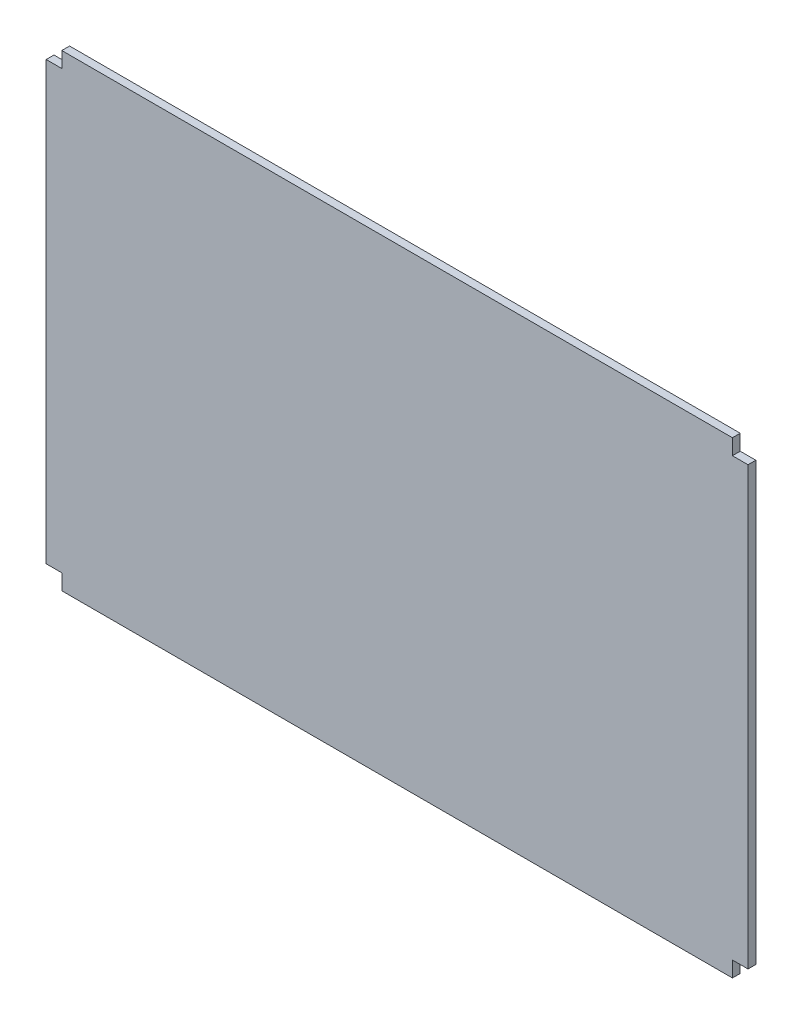
ISO-10303-21;
HEADER;
FILE_DESCRIPTION(('STEP AP214'),'2;1');
FILE_NAME('part.step','',(''),(''),'','','');
FILE_SCHEMA(('AUTOMOTIVE_DESIGN { 1 0 10303 214 1 1 1 1 }'));
ENDSEC;
DATA;
#1=APPLICATION_CONTEXT('core data for automotive mechanical design processes');
#2=APPLICATION_PROTOCOL_DEFINITION('international standard','automotive_design',2000,#1);
#3=PRODUCT_CONTEXT('',#1,'mechanical');
#4=PRODUCT('Part','Part','',(#3));
#5=PRODUCT_RELATED_PRODUCT_CATEGORY('part','',(#4));
#6=PRODUCT_DEFINITION_FORMATION('','',#4);
#7=PRODUCT_DEFINITION_CONTEXT('part definition',#1,'design');
#8=PRODUCT_DEFINITION('design','',#6,#7);
#9=PRODUCT_DEFINITION_SHAPE('','',#8);
#10=(LENGTH_UNIT() NAMED_UNIT(*) SI_UNIT(.MILLI.,.METRE.));
#11=(NAMED_UNIT(*) PLANE_ANGLE_UNIT() SI_UNIT($,.RADIAN.));
#12=(NAMED_UNIT(*) SI_UNIT($,.STERADIAN.) SOLID_ANGLE_UNIT());
#13=UNCERTAINTY_MEASURE_WITH_UNIT(LENGTH_MEASURE(1.E-05),#10,'distance_accuracy_value','');
#14=(GEOMETRIC_REPRESENTATION_CONTEXT(3) GLOBAL_UNCERTAINTY_ASSIGNED_CONTEXT((#13)) GLOBAL_UNIT_ASSIGNED_CONTEXT((#10,
#11,#12)) REPRESENTATION_CONTEXT('',''));
#15=CARTESIAN_POINT('',(0.,0.,0.));
#16=DIRECTION('',(0.,0.,1.));
#17=DIRECTION('',(1.,0.,0.));
#18=AXIS2_PLACEMENT_3D('',#15,#16,#17);
#19=CARTESIAN_POINT('',(0.,0.,10.));
#20=DIRECTION('',(1.,0.,0.));
#21=DIRECTION('',(0.,0.,-1.));
#22=AXIS2_PLACEMENT_3D('',#19,#20,#21);
#23=PLANE('',#22);
#24=DIRECTION('',(0.,-1.,0.));
#25=VECTOR('',#24,1.);
#26=CARTESIAN_POINT('',(0.,0.,0.));
#27=LINE('',#26,#25);
#28=CARTESIAN_POINT('',(0.,580.,0.));
#29=VERTEX_POINT('',#28);
#30=CARTESIAN_POINT('',(0.,19.9999999999999,0.));
#31=VERTEX_POINT('',#30);
#32=EDGE_CURVE('E158',#29,#31,#27,.T.);
#33=ORIENTED_EDGE('',*,*,#32,.T.);
#34=DIRECTION('',(0.,0.,1.));
#35=VECTOR('',#34,1.);
#36=CARTESIAN_POINT('',(0.,19.9999999999999,0.));
#37=LINE('',#36,#35);
#38=CARTESIAN_POINT('',(0.,19.9999999999999,10.));
#39=VERTEX_POINT('',#38);
#40=EDGE_CURVE('E186',#31,#39,#37,.T.);
#41=ORIENTED_EDGE('',*,*,#40,.T.);
#42=DIRECTION('',(0.,-1.,0.));
#43=VECTOR('',#42,1.);
#44=CARTESIAN_POINT('',(0.,0.,10.));
#45=LINE('',#44,#43);
#46=CARTESIAN_POINT('',(0.,580.,10.));
#47=VERTEX_POINT('',#46);
#48=EDGE_CURVE('E146',#47,#39,#45,.T.);
#49=ORIENTED_EDGE('',*,*,#48,.F.);
#50=DIRECTION('',(0.,0.,1.));
#51=VECTOR('',#50,1.);
#52=CARTESIAN_POINT('',(0.,580.,0.));
#53=LINE('',#52,#51);
#54=EDGE_CURVE('E168',#29,#47,#53,.T.);
#55=ORIENTED_EDGE('',*,*,#54,.F.);
#56=EDGE_LOOP('',(#33,#41,#49,#55));
#57=FACE_BOUND('',#56,.T.);
#58=ADVANCED_FACE('F33',(#57),#23,.F.);
#59=CARTESIAN_POINT('',(0.,0.,10.));
#60=DIRECTION('',(0.,1.,0.));
#61=DIRECTION('',(0.,0.,1.));
#62=AXIS2_PLACEMENT_3D('',#59,#60,#61);
#63=PLANE('',#62);
#64=DIRECTION('',(1.,0.,0.));
#65=VECTOR('',#64,1.);
#66=CARTESIAN_POINT('',(0.,0.,10.));
#67=LINE('',#66,#65);
#68=CARTESIAN_POINT('',(20.0000000000001,0.,10.));
#69=VERTEX_POINT('',#68);
#70=CARTESIAN_POINT('',(880.,0.,10.));
#71=VERTEX_POINT('',#70);
#72=EDGE_CURVE('E149',#69,#71,#67,.T.);
#73=ORIENTED_EDGE('',*,*,#72,.F.);
#74=DIRECTION('',(0.,0.,1.));
#75=VECTOR('',#74,1.);
#76=CARTESIAN_POINT('',(20.0000000000001,0.,0.));
#77=LINE('',#76,#75);
#78=CARTESIAN_POINT('',(20.0000000000001,0.,0.));
#79=VERTEX_POINT('',#78);
#80=EDGE_CURVE('E182',#79,#69,#77,.T.);
#81=ORIENTED_EDGE('',*,*,#80,.F.);
#82=DIRECTION('',(1.,0.,0.));
#83=VECTOR('',#82,1.);
#84=CARTESIAN_POINT('',(0.,0.,0.));
#85=LINE('',#84,#83);
#86=CARTESIAN_POINT('',(880.,0.,0.));
#87=VERTEX_POINT('',#86);
#88=EDGE_CURVE('E152',#79,#87,#85,.T.);
#89=ORIENTED_EDGE('',*,*,#88,.T.);
#90=DIRECTION('',(0.,0.,1.));
#91=VECTOR('',#90,1.);
#92=CARTESIAN_POINT('',(880.,0.,0.));
#93=LINE('',#92,#91);
#94=EDGE_CURVE('E203',#87,#71,#93,.T.);
#95=ORIENTED_EDGE('',*,*,#94,.T.);
#96=EDGE_LOOP('',(#73,#81,#89,#95));
#97=FACE_BOUND('',#96,.T.);
#98=ADVANCED_FACE('F234',(#97),#63,.F.);
#99=CARTESIAN_POINT('',(900.,0.,10.));
#100=DIRECTION('',(-1.,0.,0.));
#101=DIRECTION('',(0.,0.,1.));
#102=AXIS2_PLACEMENT_3D('',#99,#100,#101);
#103=PLANE('',#102);
#104=DIRECTION('',(0.,1.,0.));
#105=VECTOR('',#104,1.);
#106=CARTESIAN_POINT('',(900.,0.,10.));
#107=LINE('',#106,#105);
#108=CARTESIAN_POINT('',(900.,20.,10.));
#109=VERTEX_POINT('',#108);
#110=CARTESIAN_POINT('',(900.,580.,10.));
#111=VERTEX_POINT('',#110);
#112=EDGE_CURVE('E41',#109,#111,#107,.T.);
#113=ORIENTED_EDGE('',*,*,#112,.F.);
#114=DIRECTION('',(0.,0.,1.));
#115=VECTOR('',#114,1.);
#116=CARTESIAN_POINT('',(900.,20.,0.));
#117=LINE('',#116,#115);
#118=CARTESIAN_POINT('',(900.,20.,0.));
#119=VERTEX_POINT('',#118);
#120=EDGE_CURVE('E199',#119,#109,#117,.T.);
#121=ORIENTED_EDGE('',*,*,#120,.F.);
#122=DIRECTION('',(0.,1.,0.));
#123=VECTOR('',#122,1.);
#124=CARTESIAN_POINT('',(900.,0.,0.));
#125=LINE('',#124,#123);
#126=CARTESIAN_POINT('',(900.,580.,0.));
#127=VERTEX_POINT('',#126);
#128=EDGE_CURVE('E147',#119,#127,#125,.T.);
#129=ORIENTED_EDGE('',*,*,#128,.T.);
#130=DIRECTION('',(0.,0.,1.));
#131=VECTOR('',#130,1.);
#132=CARTESIAN_POINT('',(900.,580.,0.));
#133=LINE('',#132,#131);
#134=EDGE_CURVE('E179',#127,#111,#133,.T.);
#135=ORIENTED_EDGE('',*,*,#134,.T.);
#136=EDGE_LOOP('',(#113,#121,#129,#135));
#137=FACE_BOUND('',#136,.T.);
#138=ADVANCED_FACE('F223',(#137),#103,.F.);
#139=CARTESIAN_POINT('',(0.,600.,10.));
#140=DIRECTION('',(0.,-1.,0.));
#141=DIRECTION('',(0.,0.,-1.));
#142=AXIS2_PLACEMENT_3D('',#139,#140,#141);
#143=PLANE('',#142);
#144=DIRECTION('',(-1.,0.,0.));
#145=VECTOR('',#144,1.);
#146=CARTESIAN_POINT('',(0.,600.,10.));
#147=LINE('',#146,#145);
#148=CARTESIAN_POINT('',(880.,600.,10.));
#149=VERTEX_POINT('',#148);
#150=CARTESIAN_POINT('',(20.,600.,10.));
#151=VERTEX_POINT('',#150);
#152=EDGE_CURVE('E11',#149,#151,#147,.T.);
#153=ORIENTED_EDGE('',*,*,#152,.F.);
#154=DIRECTION('',(0.,0.,1.));
#155=VECTOR('',#154,1.);
#156=CARTESIAN_POINT('',(880.,600.,0.));
#157=LINE('',#156,#155);
#158=CARTESIAN_POINT('',(880.,600.,0.));
#159=VERTEX_POINT('',#158);
#160=EDGE_CURVE('E127',#159,#149,#157,.T.);
#161=ORIENTED_EDGE('',*,*,#160,.F.);
#162=DIRECTION('',(-1.,0.,0.));
#163=VECTOR('',#162,1.);
#164=CARTESIAN_POINT('',(0.,600.,0.));
#165=LINE('',#164,#163);
#166=CARTESIAN_POINT('',(20.,600.,0.));
#167=VERTEX_POINT('',#166);
#168=EDGE_CURVE('E36',#159,#167,#165,.T.);
#169=ORIENTED_EDGE('',*,*,#168,.T.);
#170=DIRECTION('',(0.,0.,1.));
#171=VECTOR('',#170,1.);
#172=CARTESIAN_POINT('',(20.,600.,0.));
#173=LINE('',#172,#171);
#174=EDGE_CURVE('E162',#167,#151,#173,.T.);
#175=ORIENTED_EDGE('',*,*,#174,.T.);
#176=EDGE_LOOP('',(#153,#161,#169,#175));
#177=FACE_BOUND('',#176,.T.);
#178=ADVANCED_FACE('F139',(#177),#143,.F.);
#179=CARTESIAN_POINT('',(0.,0.,10.));
#180=DIRECTION('',(0.,0.,-1.));
#181=DIRECTION('',(-1.,0.,0.));
#182=AXIS2_PLACEMENT_3D('',#179,#180,#181);
#183=PLANE('',#182);
#184=ORIENTED_EDGE('',*,*,#48,.T.);
#185=DIRECTION('',(-1.,0.,0.));
#186=VECTOR('',#185,1.);
#187=CARTESIAN_POINT('',(0.,19.9999999999999,10.));
#188=LINE('',#187,#186);
#189=CARTESIAN_POINT('',(20.0000000000001,19.9999999999999,10.));
#190=VERTEX_POINT('',#189);
#191=EDGE_CURVE('E190',#190,#39,#188,.T.);
#192=ORIENTED_EDGE('',*,*,#191,.F.);
#193=DIRECTION('',(0.,1.,0.));
#194=VECTOR('',#193,1.);
#195=CARTESIAN_POINT('',(20.0000000000001,0.,10.));
#196=LINE('',#195,#194);
#197=EDGE_CURVE('E193',#69,#190,#196,.T.);
#198=ORIENTED_EDGE('',*,*,#197,.F.);
#199=ORIENTED_EDGE('',*,*,#72,.T.);
#200=DIRECTION('',(0.,-1.,0.));
#201=VECTOR('',#200,1.);
#202=CARTESIAN_POINT('',(880.,0.,10.));
#203=LINE('',#202,#201);
#204=CARTESIAN_POINT('',(880.,20.,10.));
#205=VERTEX_POINT('',#204);
#206=EDGE_CURVE('E207',#205,#71,#203,.T.);
#207=ORIENTED_EDGE('',*,*,#206,.F.);
#208=DIRECTION('',(-1.,0.,0.));
#209=VECTOR('',#208,1.);
#210=CARTESIAN_POINT('',(900.,20.,10.));
#211=LINE('',#210,#209);
#212=EDGE_CURVE('E189',#109,#205,#211,.T.);
#213=ORIENTED_EDGE('',*,*,#212,.F.);
#214=ORIENTED_EDGE('',*,*,#112,.T.);
#215=DIRECTION('',(1.,0.,0.));
#216=VECTOR('',#215,1.);
#217=CARTESIAN_POINT('',(900.,580.,10.));
#218=LINE('',#217,#216);
#219=CARTESIAN_POINT('',(880.,580.,10.));
#220=VERTEX_POINT('',#219);
#221=EDGE_CURVE('E134',#220,#111,#218,.T.);
#222=ORIENTED_EDGE('',*,*,#221,.F.);
#223=DIRECTION('',(0.,-1.,0.));
#224=VECTOR('',#223,1.);
#225=CARTESIAN_POINT('',(880.,600.,10.));
#226=LINE('',#225,#224);
#227=EDGE_CURVE('E206',#149,#220,#226,.T.);
#228=ORIENTED_EDGE('',*,*,#227,.F.);
#229=ORIENTED_EDGE('',*,*,#152,.T.);
#230=DIRECTION('',(0.,1.,0.));
#231=VECTOR('',#230,1.);
#232=CARTESIAN_POINT('',(20.,600.,10.));
#233=LINE('',#232,#231);
#234=CARTESIAN_POINT('',(20.,580.,10.));
#235=VERTEX_POINT('',#234);
#236=EDGE_CURVE('E173',#235,#151,#233,.T.);
#237=ORIENTED_EDGE('',*,*,#236,.F.);
#238=DIRECTION('',(1.,0.,0.));
#239=VECTOR('',#238,1.);
#240=CARTESIAN_POINT('',(0.,580.,10.));
#241=LINE('',#240,#239);
#242=EDGE_CURVE('E176',#47,#235,#241,.T.);
#243=ORIENTED_EDGE('',*,*,#242,.F.);
#244=EDGE_LOOP('',(#184,#192,#198,#199,#207,#213,#214,#222,#228,#229,#237,#243));
#245=FACE_BOUND('',#244,.T.);
#246=ADVANCED_FACE('F226',(#245),#183,.F.);
#247=CARTESIAN_POINT('',(0.,0.,0.));
#248=DIRECTION('',(0.,0.,-1.));
#249=DIRECTION('',(-1.,0.,0.));
#250=AXIS2_PLACEMENT_3D('',#247,#248,#249);
#251=PLANE('',#250);
#252=DIRECTION('',(-1.,0.,0.));
#253=VECTOR('',#252,1.);
#254=CARTESIAN_POINT('',(0.,19.9999999999999,0.));
#255=LINE('',#254,#253);
#256=CARTESIAN_POINT('',(20.0000000000001,19.9999999999999,0.));
#257=VERTEX_POINT('',#256);
#258=EDGE_CURVE('E49',#257,#31,#255,.T.);
#259=ORIENTED_EDGE('',*,*,#258,.T.);
#260=ORIENTED_EDGE('',*,*,#32,.F.);
#261=DIRECTION('',(1.,0.,0.));
#262=VECTOR('',#261,1.);
#263=CARTESIAN_POINT('',(0.,580.,0.));
#264=LINE('',#263,#262);
#265=CARTESIAN_POINT('',(20.,580.,0.));
#266=VERTEX_POINT('',#265);
#267=EDGE_CURVE('E175',#29,#266,#264,.T.);
#268=ORIENTED_EDGE('',*,*,#267,.T.);
#269=DIRECTION('',(0.,1.,0.));
#270=VECTOR('',#269,1.);
#271=CARTESIAN_POINT('',(20.,600.,0.));
#272=LINE('',#271,#270);
#273=EDGE_CURVE('E145',#266,#167,#272,.T.);
#274=ORIENTED_EDGE('',*,*,#273,.T.);
#275=ORIENTED_EDGE('',*,*,#168,.F.);
#276=DIRECTION('',(0.,-1.,0.));
#277=VECTOR('',#276,1.);
#278=CARTESIAN_POINT('',(880.,600.,0.));
#279=LINE('',#278,#277);
#280=CARTESIAN_POINT('',(880.,580.,0.));
#281=VERTEX_POINT('',#280);
#282=EDGE_CURVE('E123',#159,#281,#279,.T.);
#283=ORIENTED_EDGE('',*,*,#282,.T.);
#284=DIRECTION('',(1.,0.,0.));
#285=VECTOR('',#284,1.);
#286=CARTESIAN_POINT('',(900.,580.,0.));
#287=LINE('',#286,#285);
#288=EDGE_CURVE('E133',#281,#127,#287,.T.);
#289=ORIENTED_EDGE('',*,*,#288,.T.);
#290=ORIENTED_EDGE('',*,*,#128,.F.);
#291=DIRECTION('',(-1.,0.,0.));
#292=VECTOR('',#291,1.);
#293=CARTESIAN_POINT('',(900.,20.,0.));
#294=LINE('',#293,#292);
#295=CARTESIAN_POINT('',(880.,20.,0.));
#296=VERTEX_POINT('',#295);
#297=EDGE_CURVE('E209',#119,#296,#294,.T.);
#298=ORIENTED_EDGE('',*,*,#297,.T.);
#299=DIRECTION('',(0.,-1.,0.));
#300=VECTOR('',#299,1.);
#301=CARTESIAN_POINT('',(880.,0.,0.));
#302=LINE('',#301,#300);
#303=EDGE_CURVE('E57',#296,#87,#302,.T.);
#304=ORIENTED_EDGE('',*,*,#303,.T.);
#305=ORIENTED_EDGE('',*,*,#88,.F.);
#306=DIRECTION('',(0.,1.,0.));
#307=VECTOR('',#306,1.);
#308=CARTESIAN_POINT('',(20.0000000000001,0.,0.));
#309=LINE('',#308,#307);
#310=EDGE_CURVE('E192',#79,#257,#309,.T.);
#311=ORIENTED_EDGE('',*,*,#310,.T.);
#312=EDGE_LOOP('',(#259,#260,#268,#274,#275,#283,#289,#290,#298,#304,#305,#311));
#313=FACE_BOUND('',#312,.T.);
#314=ADVANCED_FACE('F143',(#313),#251,.T.);
#315=CARTESIAN_POINT('',(20.,600.,0.));
#316=DIRECTION('',(1.,0.,0.));
#317=DIRECTION('',(0.,1.,0.));
#318=AXIS2_PLACEMENT_3D('',#315,#316,#317);
#319=PLANE('',#318);
#320=ORIENTED_EDGE('',*,*,#236,.T.);
#321=ORIENTED_EDGE('',*,*,#174,.F.);
#322=ORIENTED_EDGE('',*,*,#273,.F.);
#323=DIRECTION('',(0.,0.,1.));
#324=VECTOR('',#323,1.);
#325=CARTESIAN_POINT('',(20.,580.,0.));
#326=LINE('',#325,#324);
#327=EDGE_CURVE('E170',#266,#235,#326,.T.);
#328=ORIENTED_EDGE('',*,*,#327,.T.);
#329=EDGE_LOOP('',(#320,#321,#322,#328));
#330=FACE_BOUND('',#329,.T.);
#331=ADVANCED_FACE('F250',(#330),#319,.F.);
#332=CARTESIAN_POINT('',(0.,580.,0.));
#333=DIRECTION('',(0.,-1.,0.));
#334=DIRECTION('',(1.,0.,0.));
#335=AXIS2_PLACEMENT_3D('',#332,#333,#334);
#336=PLANE('',#335);
#337=ORIENTED_EDGE('',*,*,#242,.T.);
#338=ORIENTED_EDGE('',*,*,#327,.F.);
#339=ORIENTED_EDGE('',*,*,#267,.F.);
#340=ORIENTED_EDGE('',*,*,#54,.T.);
#341=EDGE_LOOP('',(#337,#338,#339,#340));
#342=FACE_BOUND('',#341,.T.);
#343=ADVANCED_FACE('F247',(#342),#336,.F.);
#344=CARTESIAN_POINT('',(900.,580.,0.));
#345=DIRECTION('',(0.,-1.,0.));
#346=DIRECTION('',(0.,0.,-1.));
#347=AXIS2_PLACEMENT_3D('',#344,#345,#346);
#348=PLANE('',#347);
#349=ORIENTED_EDGE('',*,*,#221,.T.);
#350=ORIENTED_EDGE('',*,*,#134,.F.);
#351=ORIENTED_EDGE('',*,*,#288,.F.);
#352=DIRECTION('',(0.,0.,1.));
#353=VECTOR('',#352,1.);
#354=CARTESIAN_POINT('',(880.,580.,0.));
#355=LINE('',#354,#353);
#356=EDGE_CURVE('E129',#281,#220,#355,.T.);
#357=ORIENTED_EDGE('',*,*,#356,.T.);
#358=EDGE_LOOP('',(#349,#350,#351,#357));
#359=FACE_BOUND('',#358,.T.);
#360=ADVANCED_FACE('F220',(#359),#348,.F.);
#361=CARTESIAN_POINT('',(880.,600.,0.));
#362=DIRECTION('',(-1.,0.,0.));
#363=DIRECTION('',(0.,0.,1.));
#364=AXIS2_PLACEMENT_3D('',#361,#362,#363);
#365=PLANE('',#364);
#366=ORIENTED_EDGE('',*,*,#227,.T.);
#367=ORIENTED_EDGE('',*,*,#356,.F.);
#368=ORIENTED_EDGE('',*,*,#282,.F.);
#369=ORIENTED_EDGE('',*,*,#160,.T.);
#370=EDGE_LOOP('',(#366,#367,#368,#369));
#371=FACE_BOUND('',#370,.T.);
#372=ADVANCED_FACE('F126',(#371),#365,.F.);
#373=CARTESIAN_POINT('',(880.,0.,0.));
#374=DIRECTION('',(-1.,0.,0.));
#375=DIRECTION('',(0.,0.,1.));
#376=AXIS2_PLACEMENT_3D('',#373,#374,#375);
#377=PLANE('',#376);
#378=ORIENTED_EDGE('',*,*,#206,.T.);
#379=ORIENTED_EDGE('',*,*,#94,.F.);
#380=ORIENTED_EDGE('',*,*,#303,.F.);
#381=DIRECTION('',(0.,0.,1.));
#382=VECTOR('',#381,1.);
#383=CARTESIAN_POINT('',(880.,20.,0.));
#384=LINE('',#383,#382);
#385=EDGE_CURVE('E201',#296,#205,#384,.T.);
#386=ORIENTED_EDGE('',*,*,#385,.T.);
#387=EDGE_LOOP('',(#378,#379,#380,#386));
#388=FACE_BOUND('',#387,.T.);
#389=ADVANCED_FACE('F307',(#388),#377,.F.);
#390=CARTESIAN_POINT('',(900.,20.,0.));
#391=DIRECTION('',(0.,1.,0.));
#392=DIRECTION('',(-1.,0.,0.));
#393=AXIS2_PLACEMENT_3D('',#390,#391,#392);
#394=PLANE('',#393);
#395=ORIENTED_EDGE('',*,*,#212,.T.);
#396=ORIENTED_EDGE('',*,*,#385,.F.);
#397=ORIENTED_EDGE('',*,*,#297,.F.);
#398=ORIENTED_EDGE('',*,*,#120,.T.);
#399=EDGE_LOOP('',(#395,#396,#397,#398));
#400=FACE_BOUND('',#399,.T.);
#401=ADVANCED_FACE('F229',(#400),#394,.F.);
#402=CARTESIAN_POINT('',(0.,19.9999999999999,0.));
#403=DIRECTION('',(0.,1.,0.));
#404=DIRECTION('',(0.,0.,1.));
#405=AXIS2_PLACEMENT_3D('',#402,#403,#404);
#406=PLANE('',#405);
#407=ORIENTED_EDGE('',*,*,#191,.T.);
#408=ORIENTED_EDGE('',*,*,#40,.F.);
#409=ORIENTED_EDGE('',*,*,#258,.F.);
#410=DIRECTION('',(0.,0.,1.));
#411=VECTOR('',#410,1.);
#412=CARTESIAN_POINT('',(20.0000000000001,19.9999999999999,0.));
#413=LINE('',#412,#411);
#414=EDGE_CURVE('E184',#257,#190,#413,.T.);
#415=ORIENTED_EDGE('',*,*,#414,.T.);
#416=EDGE_LOOP('',(#407,#408,#409,#415));
#417=FACE_BOUND('',#416,.T.);
#418=ADVANCED_FACE('F241',(#417),#406,.F.);
#419=CARTESIAN_POINT('',(20.0000000000001,0.,0.));
#420=DIRECTION('',(1.,0.,0.));
#421=DIRECTION('',(0.,0.,-1.));
#422=AXIS2_PLACEMENT_3D('',#419,#420,#421);
#423=PLANE('',#422);
#424=ORIENTED_EDGE('',*,*,#197,.T.);
#425=ORIENTED_EDGE('',*,*,#414,.F.);
#426=ORIENTED_EDGE('',*,*,#310,.F.);
#427=ORIENTED_EDGE('',*,*,#80,.T.);
#428=EDGE_LOOP('',(#424,#425,#426,#427));
#429=FACE_BOUND('',#428,.T.);
#430=ADVANCED_FACE('F237',(#429),#423,.F.);
#431=CLOSED_SHELL('',(#58,#98,#138,#178,#246,#314,#331,#343,#360,#372,#389,#401,#418,#430));
#432=MANIFOLD_SOLID_BREP('B2',#431);
#433=ADVANCED_BREP_SHAPE_REPRESENTATION('',(#18,#432),#14);
#434=SHAPE_DEFINITION_REPRESENTATION(#9,#433);
ENDSEC;
END-ISO-10303-21;
